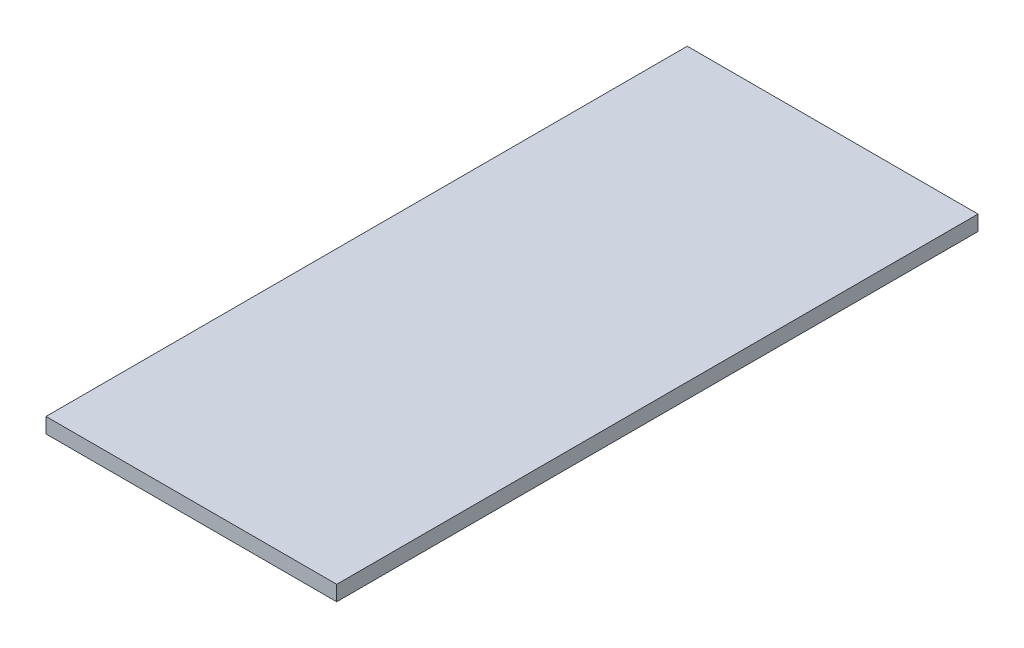
ISO-10303-21;
HEADER;
FILE_DESCRIPTION(('STEP AP214'),'2;1');
FILE_NAME('part.step','',(''),(''),'','','');
FILE_SCHEMA(('AUTOMOTIVE_DESIGN { 1 0 10303 214 1 1 1 1 }'));
ENDSEC;
DATA;
#1=APPLICATION_CONTEXT('core data for automotive mechanical design processes');
#2=APPLICATION_PROTOCOL_DEFINITION('international standard','automotive_design',2000,#1);
#3=PRODUCT_CONTEXT('',#1,'mechanical');
#4=PRODUCT('Part','Part','',(#3));
#5=PRODUCT_RELATED_PRODUCT_CATEGORY('part','',(#4));
#6=PRODUCT_DEFINITION_FORMATION('','',#4);
#7=PRODUCT_DEFINITION_CONTEXT('part definition',#1,'design');
#8=PRODUCT_DEFINITION('design','',#6,#7);
#9=PRODUCT_DEFINITION_SHAPE('','',#8);
#10=(LENGTH_UNIT() NAMED_UNIT(*) SI_UNIT(.MILLI.,.METRE.));
#11=(NAMED_UNIT(*) PLANE_ANGLE_UNIT() SI_UNIT($,.RADIAN.));
#12=(NAMED_UNIT(*) SI_UNIT($,.STERADIAN.) SOLID_ANGLE_UNIT());
#13=UNCERTAINTY_MEASURE_WITH_UNIT(LENGTH_MEASURE(1.E-05),#10,'distance_accuracy_value','');
#14=(GEOMETRIC_REPRESENTATION_CONTEXT(3) GLOBAL_UNCERTAINTY_ASSIGNED_CONTEXT((#13)) GLOBAL_UNIT_ASSIGNED_CONTEXT((#10,
#11,#12)) REPRESENTATION_CONTEXT('',''));
#15=CARTESIAN_POINT('',(0.,0.,0.));
#16=DIRECTION('',(0.,0.,1.));
#17=DIRECTION('',(1.,0.,0.));
#18=AXIS2_PLACEMENT_3D('',#15,#16,#17);
#19=CARTESIAN_POINT('',(-172.5,18.,380.5));
#20=DIRECTION('',(1.,0.,0.));
#21=DIRECTION('',(0.,0.,-1.));
#22=AXIS2_PLACEMENT_3D('',#19,#20,#21);
#23=PLANE('',#22);
#24=DIRECTION('',(0.,0.,1.));
#25=VECTOR('',#24,1.);
#26=CARTESIAN_POINT('',(-172.5,0.,380.5));
#27=LINE('',#26,#25);
#28=CARTESIAN_POINT('',(-172.5,0.,-380.5));
#29=VERTEX_POINT('',#28);
#30=CARTESIAN_POINT('',(-172.5,0.,380.5));
#31=VERTEX_POINT('',#30);
#32=EDGE_CURVE('E98',#29,#31,#27,.T.);
#33=ORIENTED_EDGE('',*,*,#32,.T.);
#34=DIRECTION('',(0.,-1.,0.));
#35=VECTOR('',#34,1.);
#36=CARTESIAN_POINT('',(-172.5,18.,380.5));
#37=LINE('',#36,#35);
#38=CARTESIAN_POINT('',(-172.5,18.,380.5));
#39=VERTEX_POINT('',#38);
#40=EDGE_CURVE('E11',#39,#31,#37,.T.);
#41=ORIENTED_EDGE('',*,*,#40,.F.);
#42=DIRECTION('',(0.,0.,1.));
#43=VECTOR('',#42,1.);
#44=CARTESIAN_POINT('',(-172.5,18.,380.5));
#45=LINE('',#44,#43);
#46=CARTESIAN_POINT('',(-172.5,18.,-380.5));
#47=VERTEX_POINT('',#46);
#48=EDGE_CURVE('E86',#47,#39,#45,.T.);
#49=ORIENTED_EDGE('',*,*,#48,.F.);
#50=DIRECTION('',(0.,-1.,0.));
#51=VECTOR('',#50,1.);
#52=CARTESIAN_POINT('',(-172.5,18.,-380.5));
#53=LINE('',#52,#51);
#54=EDGE_CURVE('E94',#47,#29,#53,.T.);
#55=ORIENTED_EDGE('',*,*,#54,.T.);
#56=EDGE_LOOP('',(#33,#41,#49,#55));
#57=FACE_BOUND('',#56,.T.);
#58=ADVANCED_FACE('F35',(#57),#23,.F.);
#59=CARTESIAN_POINT('',(172.5,18.,380.5));
#60=DIRECTION('',(0.,0.,-1.));
#61=DIRECTION('',(-1.,0.,0.));
#62=AXIS2_PLACEMENT_3D('',#59,#60,#61);
#63=PLANE('',#62);
#64=DIRECTION('',(1.,0.,0.));
#65=VECTOR('',#64,1.);
#66=CARTESIAN_POINT('',(172.5,0.,380.5));
#67=LINE('',#66,#65);
#68=CARTESIAN_POINT('',(172.5,0.,380.5));
#69=VERTEX_POINT('',#68);
#70=EDGE_CURVE('E90',#31,#69,#67,.T.);
#71=ORIENTED_EDGE('',*,*,#70,.T.);
#72=DIRECTION('',(0.,-1.,0.));
#73=VECTOR('',#72,1.);
#74=CARTESIAN_POINT('',(172.5,18.,380.5));
#75=LINE('',#74,#73);
#76=CARTESIAN_POINT('',(172.5,18.,380.5));
#77=VERTEX_POINT('',#76);
#78=EDGE_CURVE('E43',#77,#69,#75,.T.);
#79=ORIENTED_EDGE('',*,*,#78,.F.);
#80=DIRECTION('',(1.,0.,0.));
#81=VECTOR('',#80,1.);
#82=CARTESIAN_POINT('',(172.5,18.,380.5));
#83=LINE('',#82,#81);
#84=EDGE_CURVE('E81',#39,#77,#83,.T.);
#85=ORIENTED_EDGE('',*,*,#84,.F.);
#86=ORIENTED_EDGE('',*,*,#40,.T.);
#87=EDGE_LOOP('',(#71,#79,#85,#86));
#88=FACE_BOUND('',#87,.T.);
#89=ADVANCED_FACE('F89',(#88),#63,.F.);
#90=CARTESIAN_POINT('',(172.5,18.,380.5));
#91=DIRECTION('',(-1.,0.,0.));
#92=DIRECTION('',(0.,0.,1.));
#93=AXIS2_PLACEMENT_3D('',#90,#91,#92);
#94=PLANE('',#93);
#95=DIRECTION('',(0.,0.,-1.));
#96=VECTOR('',#95,1.);
#97=CARTESIAN_POINT('',(172.5,0.,380.5));
#98=LINE('',#97,#96);
#99=CARTESIAN_POINT('',(172.5,0.,-380.5));
#100=VERTEX_POINT('',#99);
#101=EDGE_CURVE('E68',#69,#100,#98,.T.);
#102=ORIENTED_EDGE('',*,*,#101,.T.);
#103=DIRECTION('',(0.,-1.,0.));
#104=VECTOR('',#103,1.);
#105=CARTESIAN_POINT('',(172.5,18.,-380.5));
#106=LINE('',#105,#104);
#107=CARTESIAN_POINT('',(172.5,18.,-380.5));
#108=VERTEX_POINT('',#107);
#109=EDGE_CURVE('E91',#108,#100,#106,.T.);
#110=ORIENTED_EDGE('',*,*,#109,.F.);
#111=DIRECTION('',(0.,0.,-1.));
#112=VECTOR('',#111,1.);
#113=CARTESIAN_POINT('',(172.5,18.,380.5));
#114=LINE('',#113,#112);
#115=EDGE_CURVE('E84',#77,#108,#114,.T.);
#116=ORIENTED_EDGE('',*,*,#115,.F.);
#117=ORIENTED_EDGE('',*,*,#78,.T.);
#118=EDGE_LOOP('',(#102,#110,#116,#117));
#119=FACE_BOUND('',#118,.T.);
#120=ADVANCED_FACE('F92',(#119),#94,.F.);
#121=CARTESIAN_POINT('',(172.5,18.,-380.5));
#122=DIRECTION('',(0.,0.,1.));
#123=DIRECTION('',(1.,0.,0.));
#124=AXIS2_PLACEMENT_3D('',#121,#122,#123);
#125=PLANE('',#124);
#126=DIRECTION('',(-1.,0.,0.));
#127=VECTOR('',#126,1.);
#128=CARTESIAN_POINT('',(172.5,0.,-380.5));
#129=LINE('',#128,#127);
#130=EDGE_CURVE('E74',#100,#29,#129,.T.);
#131=ORIENTED_EDGE('',*,*,#130,.T.);
#132=ORIENTED_EDGE('',*,*,#54,.F.);
#133=DIRECTION('',(-1.,0.,0.));
#134=VECTOR('',#133,1.);
#135=CARTESIAN_POINT('',(172.5,18.,-380.5));
#136=LINE('',#135,#134);
#137=EDGE_CURVE('E51',#108,#47,#136,.T.);
#138=ORIENTED_EDGE('',*,*,#137,.F.);
#139=ORIENTED_EDGE('',*,*,#109,.T.);
#140=EDGE_LOOP('',(#131,#132,#138,#139));
#141=FACE_BOUND('',#140,.T.);
#142=ADVANCED_FACE('F105',(#141),#125,.F.);
#143=CARTESIAN_POINT('',(0.,18.,0.));
#144=DIRECTION('',(0.,1.,0.));
#145=DIRECTION('',(0.,0.,1.));
#146=AXIS2_PLACEMENT_3D('',#143,#144,#145);
#147=PLANE('',#146);
#148=ORIENTED_EDGE('',*,*,#48,.T.);
#149=ORIENTED_EDGE('',*,*,#84,.T.);
#150=ORIENTED_EDGE('',*,*,#115,.T.);
#151=ORIENTED_EDGE('',*,*,#137,.T.);
#152=EDGE_LOOP('',(#148,#149,#150,#151));
#153=FACE_BOUND('',#152,.T.);
#154=ADVANCED_FACE('F82',(#153),#147,.T.);
#155=CARTESIAN_POINT('',(0.,0.,0.));
#156=DIRECTION('',(0.,1.,0.));
#157=DIRECTION('',(0.,0.,1.));
#158=AXIS2_PLACEMENT_3D('',#155,#156,#157);
#159=PLANE('',#158);
#160=ORIENTED_EDGE('',*,*,#32,.F.);
#161=ORIENTED_EDGE('',*,*,#130,.F.);
#162=ORIENTED_EDGE('',*,*,#101,.F.);
#163=ORIENTED_EDGE('',*,*,#70,.F.);
#164=EDGE_LOOP('',(#160,#161,#162,#163));
#165=FACE_BOUND('',#164,.T.);
#166=ADVANCED_FACE('F108',(#165),#159,.F.);
#167=CLOSED_SHELL('',(#58,#89,#120,#142,#154,#166));
#168=MANIFOLD_SOLID_BREP('B2',#167);
#169=ADVANCED_BREP_SHAPE_REPRESENTATION('',(#18,#168),#14);
#170=SHAPE_DEFINITION_REPRESENTATION(#9,#169);
ENDSEC;
END-ISO-10303-21;
